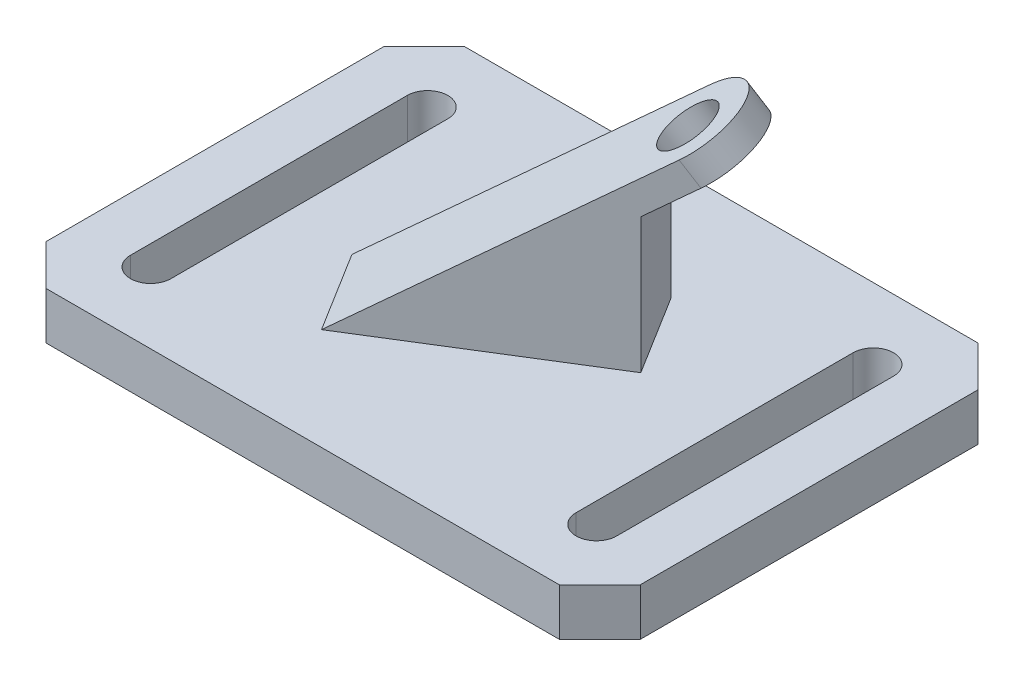
ISO-10303-21;
HEADER;
FILE_DESCRIPTION(('STEP AP214'),'2;1');
FILE_NAME('part.step','',(''),(''),'','','');
FILE_SCHEMA(('AUTOMOTIVE_DESIGN { 1 0 10303 214 1 1 1 1 }'));
ENDSEC;
DATA;
#1=APPLICATION_CONTEXT('core data for automotive mechanical design processes');
#2=APPLICATION_PROTOCOL_DEFINITION('international standard','automotive_design',2000,#1);
#3=PRODUCT_CONTEXT('',#1,'mechanical');
#4=PRODUCT('Part','Part','',(#3));
#5=PRODUCT_RELATED_PRODUCT_CATEGORY('part','',(#4));
#6=PRODUCT_DEFINITION_FORMATION('','',#4);
#7=PRODUCT_DEFINITION_CONTEXT('part definition',#1,'design');
#8=PRODUCT_DEFINITION('design','',#6,#7);
#9=PRODUCT_DEFINITION_SHAPE('','',#8);
#10=(LENGTH_UNIT() NAMED_UNIT(*) SI_UNIT(.MILLI.,.METRE.));
#11=(NAMED_UNIT(*) PLANE_ANGLE_UNIT() SI_UNIT($,.RADIAN.));
#12=(NAMED_UNIT(*) SI_UNIT($,.STERADIAN.) SOLID_ANGLE_UNIT());
#13=UNCERTAINTY_MEASURE_WITH_UNIT(LENGTH_MEASURE(1.E-05),#10,'distance_accuracy_value','');
#14=(GEOMETRIC_REPRESENTATION_CONTEXT(3) GLOBAL_UNCERTAINTY_ASSIGNED_CONTEXT((#13)) GLOBAL_UNIT_ASSIGNED_CONTEXT((#10,
#11,#12)) REPRESENTATION_CONTEXT('',''));
#15=CARTESIAN_POINT('',(0.,0.,0.));
#16=DIRECTION('',(0.,0.,1.));
#17=DIRECTION('',(1.,0.,0.));
#18=AXIS2_PLACEMENT_3D('',#15,#16,#17);
#19=CARTESIAN_POINT('',(17.7698072711224,39.0528467618868,-19.2795308317588));
#20=DIRECTION('',(0.499289040047183,-0.809016994374951,-0.310164403665674));
#21=DIRECTION('',(0.850985081019819,0.525189862698903,0.));
#22=AXIS2_PLACEMENT_3D('',#19,#20,#21);
#23=PLANE('',#22);
#24=CARTESIAN_POINT('',(16.0670555017936,34.4370930765119,-9.9810496299021));
#25=DIRECTION('',(-0.499289040047183,0.809016994374951,0.310164403665674));
#26=DIRECTION('',(-0.850985081019819,-0.525189862698903,0.));
#27=AXIS2_PLACEMENT_3D('',#24,#25,#26);
#28=CIRCLE('',#27,4.);
#29=CARTESIAN_POINT('',(12.6631151777143,32.3363336257162,-9.9810496299021));
#30=VERTEX_POINT('',#29);
#31=EDGE_CURVE('E427',#30,#30,#28,.T.);
#32=ORIENTED_EDGE('',*,*,#31,.F.);
#33=EDGE_LOOP('',(#32));
#34=FACE_BOUND('',#33,.T.);
#35=DIRECTION('',(0.687212407810359,0.587785252292468,-0.426904677579162));
#36=VECTOR('',#35,1.);
#37=CARTESIAN_POINT('',(25.157372090729,39.0528467618868,-7.38735331727008));
#38=LINE('',#37,#36);
#39=CARTESIAN_POINT('',(-12.3173925694985,7.,15.8924247292349));
#40=VERTEX_POINT('',#39);
#41=CARTESIAN_POINT('',(20.3468852360565,34.9383499958396,-4.39902057421596));
#42=VERTEX_POINT('',#41);
#43=EDGE_CURVE('E217',#40,#42,#38,.T.);
#44=ORIENTED_EDGE('',*,*,#43,.T.);
#45=CARTESIAN_POINT('',(16.6531028262532,34.9383499958395,-10.3451093314603));
#46=DIRECTION('',(-0.499289040047183,0.809016994374951,0.310164403665674));
#47=DIRECTION('',(-0.850985081019819,-0.525189862698903,0.));
#48=AXIS2_PLACEMENT_3D('',#45,#46,#47);
#49=CIRCLE('',#48,7.);
#50=CARTESIAN_POINT('',(12.9593204164499,34.9383499958396,-16.2911980887047));
#51=VERTEX_POINT('',#50);
#52=EDGE_CURVE('E204',#42,#51,#49,.T.);
#53=ORIENTED_EDGE('',*,*,#52,.T.);
#54=DIRECTION('',(0.687212407810359,0.587785252292468,-0.426904677579162));
#55=VECTOR('',#54,1.);
#56=CARTESIAN_POINT('',(17.7698072711224,39.0528467618868,-19.2795308317588));
#57=LINE('',#56,#55);
#58=CARTESIAN_POINT('',(-19.7049573891052,7.,4.00024721474618));
#59=VERTEX_POINT('',#58);
#60=EDGE_CURVE('E237',#59,#51,#57,.T.);
#61=ORIENTED_EDGE('',*,*,#60,.F.);
#62=DIRECTION('',(0.527683201400473,0.,0.849441251034907));
#63=VECTOR('',#62,1.);
#64=CARTESIAN_POINT('',(-19.7049573891052,7.,4.00024721474619));
#65=LINE('',#64,#63);
#66=EDGE_CURVE('E86',#59,#40,#65,.T.);
#67=ORIENTED_EDGE('',*,*,#66,.T.);
#68=EDGE_LOOP('',(#44,#53,#61,#67));
#69=FACE_BOUND('',#68,.T.);
#70=ADVANCED_FACE('F61',(#34,#69),#23,.F.);
#71=CARTESIAN_POINT('',(9.45877731415572,27.,-14.1166182827341));
#72=DIRECTION('',(-0.499289040047183,0.809016994374951,0.310164403665674));
#73=DIRECTION('',(-0.850985081019819,-0.525189862698903,0.));
#74=AXIS2_PLACEMENT_3D('',#71,#72,#73);
#75=PLANE('',#74);
#76=CARTESIAN_POINT('',(18.0642116619823,31.2010250990121,-11.2217072445648));
#77=DIRECTION('',(-0.499289040047183,0.809016994374951,0.310164403665674));
#78=DIRECTION('',(-0.850985081019819,-0.525189862698903,0.));
#79=AXIS2_PLACEMENT_3D('',#76,#77,#78);
#80=CIRCLE('',#79,4.);
#81=CARTESIAN_POINT('',(14.6602713379031,29.1002656482164,-11.2217072445648));
#82=VERTEX_POINT('',#81);
#83=EDGE_CURVE('E65',#82,#82,#80,.T.);
#84=ORIENTED_EDGE('',*,*,#83,.T.);
#85=EDGE_LOOP('',(#84));
#86=FACE_BOUND('',#85,.T.);
#87=CARTESIAN_POINT('',(18.6502589864419,31.7022820183397,-11.585766946123));
#88=DIRECTION('',(-0.499289040047183,0.809016994374951,0.310164403665674));
#89=DIRECTION('',(-0.850985081019819,-0.525189862698903,0.));
#90=AXIS2_PLACEMENT_3D('',#87,#88,#89);
#91=CIRCLE('',#90,7.);
#92=CARTESIAN_POINT('',(22.3440413962452,31.7022820183398,-5.63967818887865));
#93=VERTEX_POINT('',#92);
#94=CARTESIAN_POINT('',(14.9564765766386,31.7022820183397,-17.5318557033673));
#95=VERTEX_POINT('',#94);
#96=EDGE_CURVE('E78',#93,#95,#91,.T.);
#97=ORIENTED_EDGE('',*,*,#96,.F.);
#98=DIRECTION('',(-0.687212407810359,-0.587785252292468,0.426904677579162));
#99=VECTOR('',#98,1.);
#100=CARTESIAN_POINT('',(16.8463421337623,27.,-2.22444076824535));
#101=LINE('',#100,#99);
#102=CARTESIAN_POINT('',(16.8463421337623,27.,-2.22444076824535));
#103=VERTEX_POINT('',#102);
#104=EDGE_CURVE('E219',#93,#103,#101,.T.);
#105=ORIENTED_EDGE('',*,*,#104,.T.);
#106=DIRECTION('',(0.527683201400473,0.,0.849441251034907));
#107=VECTOR('',#106,1.);
#108=CARTESIAN_POINT('',(9.45877731415572,27.,-14.1166182827341));
#109=LINE('',#108,#107);
#110=CARTESIAN_POINT('',(9.45877731415572,27.,-14.1166182827341));
#111=VERTEX_POINT('',#110);
#112=EDGE_CURVE('E243',#111,#103,#109,.T.);
#113=ORIENTED_EDGE('',*,*,#112,.F.);
#114=DIRECTION('',(-0.687212407810359,-0.587785252292468,0.426904677579162));
#115=VECTOR('',#114,1.);
#116=CARTESIAN_POINT('',(9.45877731415572,27.,-14.1166182827341));
#117=LINE('',#116,#115);
#118=EDGE_CURVE('E421',#95,#111,#117,.T.);
#119=ORIENTED_EDGE('',*,*,#118,.F.);
#120=EDGE_LOOP('',(#97,#105,#113,#119));
#121=FACE_BOUND('',#120,.T.);
#122=ADVANCED_FACE('F436',(#86,#121),#75,.F.);
#123=CARTESIAN_POINT('',(0.,7.,0.));
#124=DIRECTION('',(0.,-1.,0.));
#125=DIRECTION('',(0.,0.,-1.));
#126=AXIS2_PLACEMENT_3D('',#123,#124,#125);
#127=PLANE('',#126);
#128=ORIENTED_EDGE('',*,*,#66,.F.);
#129=DIRECTION('',(-0.849441251034907,0.,0.527683201400473));
#130=VECTOR('',#129,1.);
#131=CARTESIAN_POINT('',(9.45877731415572,7.,-14.1166182827341));
#132=LINE('',#131,#130);
#133=CARTESIAN_POINT('',(9.45877731415572,7.,-14.1166182827341));
#134=VERTEX_POINT('',#133);
#135=EDGE_CURVE('E228',#134,#59,#132,.T.);
#136=ORIENTED_EDGE('',*,*,#135,.F.);
#137=DIRECTION('',(0.527683201400473,0.,0.849441251034907));
#138=VECTOR('',#137,1.);
#139=CARTESIAN_POINT('',(9.45877731415572,7.,-14.1166182827341));
#140=LINE('',#139,#138);
#141=CARTESIAN_POINT('',(16.8463421337623,7.,-2.22444076824535));
#142=VERTEX_POINT('',#141);
#143=EDGE_CURVE('E240',#134,#142,#140,.T.);
#144=ORIENTED_EDGE('',*,*,#143,.T.);
#145=DIRECTION('',(-0.849441251034907,0.,0.527683201400473));
#146=VECTOR('',#145,1.);
#147=CARTESIAN_POINT('',(-12.3173925694985,7.,15.8924247292349));
#148=LINE('',#147,#146);
#149=EDGE_CURVE('E234',#142,#40,#148,.T.);
#150=ORIENTED_EDGE('',*,*,#149,.T.);
#151=EDGE_LOOP('',(#128,#136,#144,#150));
#152=FACE_BOUND('',#151,.T.);
#153=CARTESIAN_POINT('',(-33.,7.,20.5));
#154=DIRECTION('',(0.,1.,0.));
#155=DIRECTION('',(0.,0.,1.));
#156=AXIS2_PLACEMENT_3D('',#153,#154,#155);
#157=CIRCLE('',#156,3.);
#158=CARTESIAN_POINT('',(-36.,7.,20.5));
#159=VERTEX_POINT('',#158);
#160=CARTESIAN_POINT('',(-30.,7.,20.5));
#161=VERTEX_POINT('',#160);
#162=EDGE_CURVE('E291',#159,#161,#157,.T.);
#163=ORIENTED_EDGE('',*,*,#162,.F.);
#164=DIRECTION('',(0.,0.,1.));
#165=VECTOR('',#164,1.);
#166=CARTESIAN_POINT('',(-36.,7.,20.5));
#167=LINE('',#166,#165);
#168=CARTESIAN_POINT('',(-36.,7.,-20.5));
#169=VERTEX_POINT('',#168);
#170=EDGE_CURVE('E302',#169,#159,#167,.T.);
#171=ORIENTED_EDGE('',*,*,#170,.F.);
#172=CARTESIAN_POINT('',(-33.,7.,-20.5));
#173=DIRECTION('',(0.,1.,0.));
#174=DIRECTION('',(0.,0.,1.));
#175=AXIS2_PLACEMENT_3D('',#172,#173,#174);
#176=CIRCLE('',#175,3.00000000000002);
#177=CARTESIAN_POINT('',(-30.,7.,-20.5));
#178=VERTEX_POINT('',#177);
#179=EDGE_CURVE('E298',#178,#169,#176,.T.);
#180=ORIENTED_EDGE('',*,*,#179,.F.);
#181=DIRECTION('',(0.,0.,-1.));
#182=VECTOR('',#181,1.);
#183=CARTESIAN_POINT('',(-30.,7.,20.5));
#184=LINE('',#183,#182);
#185=EDGE_CURVE('E294',#161,#178,#184,.T.);
#186=ORIENTED_EDGE('',*,*,#185,.F.);
#187=EDGE_LOOP('',(#163,#171,#180,#186));
#188=FACE_BOUND('',#187,.T.);
#189=DIRECTION('',(-1.,0.,0.));
#190=VECTOR('',#189,1.);
#191=CARTESIAN_POINT('',(-38.,7.,-31.));
#192=LINE('',#191,#190);
#193=CARTESIAN_POINT('',(38.,7.,-31.));
#194=VERTEX_POINT('',#193);
#195=CARTESIAN_POINT('',(-38.,7.,-31.));
#196=VERTEX_POINT('',#195);
#197=EDGE_CURVE('E334',#194,#196,#192,.T.);
#198=ORIENTED_EDGE('',*,*,#197,.T.);
#199=DIRECTION('',(-0.707106781186547,0.,0.707106781186548));
#200=VECTOR('',#199,1.);
#201=CARTESIAN_POINT('',(-44.,7.,-25.));
#202=LINE('',#201,#200);
#203=CARTESIAN_POINT('',(-44.,7.,-25.));
#204=VERTEX_POINT('',#203);
#205=EDGE_CURVE('E338',#196,#204,#202,.T.);
#206=ORIENTED_EDGE('',*,*,#205,.T.);
#207=DIRECTION('',(0.,0.,1.));
#208=VECTOR('',#207,1.);
#209=CARTESIAN_POINT('',(-44.,7.,-25.));
#210=LINE('',#209,#208);
#211=CARTESIAN_POINT('',(-44.,7.,25.));
#212=VERTEX_POINT('',#211);
#213=EDGE_CURVE('E342',#204,#212,#210,.T.);
#214=ORIENTED_EDGE('',*,*,#213,.T.);
#215=DIRECTION('',(0.707106781186547,0.,0.707106781186548));
#216=VECTOR('',#215,1.);
#217=CARTESIAN_POINT('',(-44.,7.,25.));
#218=LINE('',#217,#216);
#219=CARTESIAN_POINT('',(-38.,7.,31.));
#220=VERTEX_POINT('',#219);
#221=EDGE_CURVE('E345',#212,#220,#218,.T.);
#222=ORIENTED_EDGE('',*,*,#221,.T.);
#223=DIRECTION('',(1.,0.,0.));
#224=VECTOR('',#223,1.);
#225=CARTESIAN_POINT('',(-38.,7.,31.));
#226=LINE('',#225,#224);
#227=CARTESIAN_POINT('',(38.,7.,31.));
#228=VERTEX_POINT('',#227);
#229=EDGE_CURVE('E348',#220,#228,#226,.T.);
#230=ORIENTED_EDGE('',*,*,#229,.T.);
#231=DIRECTION('',(0.707106781186548,0.,-0.707106781186547));
#232=VECTOR('',#231,1.);
#233=CARTESIAN_POINT('',(38.,7.,31.));
#234=LINE('',#233,#232);
#235=CARTESIAN_POINT('',(44.,7.,25.));
#236=VERTEX_POINT('',#235);
#237=EDGE_CURVE('E351',#228,#236,#234,.T.);
#238=ORIENTED_EDGE('',*,*,#237,.T.);
#239=DIRECTION('',(0.,0.,-1.));
#240=VECTOR('',#239,1.);
#241=CARTESIAN_POINT('',(44.,7.,-25.));
#242=LINE('',#241,#240);
#243=CARTESIAN_POINT('',(44.,7.,-25.));
#244=VERTEX_POINT('',#243);
#245=EDGE_CURVE('E354',#236,#244,#242,.T.);
#246=ORIENTED_EDGE('',*,*,#245,.T.);
#247=DIRECTION('',(-0.707106781186548,0.,-0.707106781186547));
#248=VECTOR('',#247,1.);
#249=CARTESIAN_POINT('',(38.,7.,-31.));
#250=LINE('',#249,#248);
#251=EDGE_CURVE('E357',#244,#194,#250,.T.);
#252=ORIENTED_EDGE('',*,*,#251,.T.);
#253=EDGE_LOOP('',(#198,#206,#214,#222,#230,#238,#246,#252));
#254=FACE_BOUND('',#253,.T.);
#255=CARTESIAN_POINT('',(33.,7.,20.5));
#256=DIRECTION('',(0.,1.,0.));
#257=DIRECTION('',(0.,0.,1.));
#258=AXIS2_PLACEMENT_3D('',#255,#256,#257);
#259=CIRCLE('',#258,3.);
#260=CARTESIAN_POINT('',(30.,7.,20.5));
#261=VERTEX_POINT('',#260);
#262=CARTESIAN_POINT('',(36.,7.,20.5));
#263=VERTEX_POINT('',#262);
#264=EDGE_CURVE('E248',#261,#263,#259,.T.);
#265=ORIENTED_EDGE('',*,*,#264,.F.);
#266=DIRECTION('',(0.,0.,1.));
#267=VECTOR('',#266,1.);
#268=CARTESIAN_POINT('',(30.,7.,20.5));
#269=LINE('',#268,#267);
#270=CARTESIAN_POINT('',(30.,7.,-20.5));
#271=VERTEX_POINT('',#270);
#272=EDGE_CURVE('E259',#271,#261,#269,.T.);
#273=ORIENTED_EDGE('',*,*,#272,.F.);
#274=CARTESIAN_POINT('',(33.,7.,-20.5));
#275=DIRECTION('',(0.,1.,0.));
#276=DIRECTION('',(0.,0.,1.));
#277=AXIS2_PLACEMENT_3D('',#274,#275,#276);
#278=CIRCLE('',#277,3.);
#279=CARTESIAN_POINT('',(36.,7.,-20.5));
#280=VERTEX_POINT('',#279);
#281=EDGE_CURVE('E255',#280,#271,#278,.T.);
#282=ORIENTED_EDGE('',*,*,#281,.F.);
#283=DIRECTION('',(0.,0.,-1.));
#284=VECTOR('',#283,1.);
#285=CARTESIAN_POINT('',(36.,7.,20.5));
#286=LINE('',#285,#284);
#287=EDGE_CURVE('E251',#263,#280,#286,.T.);
#288=ORIENTED_EDGE('',*,*,#287,.F.);
#289=EDGE_LOOP('',(#265,#273,#282,#288));
#290=FACE_BOUND('',#289,.T.);
#291=ADVANCED_FACE('F453',(#152,#188,#254,#290),#127,.F.);
#292=CARTESIAN_POINT('',(0.,0.,0.));
#293=DIRECTION('',(0.,-1.,0.));
#294=DIRECTION('',(0.,0.,-1.));
#295=AXIS2_PLACEMENT_3D('',#292,#293,#294);
#296=PLANE('',#295);
#297=DIRECTION('',(-1.,0.,0.));
#298=VECTOR('',#297,1.);
#299=CARTESIAN_POINT('',(-38.,0.,-31.));
#300=LINE('',#299,#298);
#301=CARTESIAN_POINT('',(38.,0.,-31.));
#302=VERTEX_POINT('',#301);
#303=CARTESIAN_POINT('',(-38.,0.,-31.));
#304=VERTEX_POINT('',#303);
#305=EDGE_CURVE('E333',#302,#304,#300,.T.);
#306=ORIENTED_EDGE('',*,*,#305,.F.);
#307=DIRECTION('',(-0.707106781186548,0.,-0.707106781186547));
#308=VECTOR('',#307,1.);
#309=CARTESIAN_POINT('',(38.,0.,-31.));
#310=LINE('',#309,#308);
#311=CARTESIAN_POINT('',(44.,0.,-25.));
#312=VERTEX_POINT('',#311);
#313=EDGE_CURVE('E339',#312,#302,#310,.T.);
#314=ORIENTED_EDGE('',*,*,#313,.F.);
#315=DIRECTION('',(0.,0.,-1.));
#316=VECTOR('',#315,1.);
#317=CARTESIAN_POINT('',(44.,0.,-25.));
#318=LINE('',#317,#316);
#319=CARTESIAN_POINT('',(44.,0.,25.));
#320=VERTEX_POINT('',#319);
#321=EDGE_CURVE('E379',#320,#312,#318,.T.);
#322=ORIENTED_EDGE('',*,*,#321,.F.);
#323=DIRECTION('',(0.707106781186548,0.,-0.707106781186547));
#324=VECTOR('',#323,1.);
#325=CARTESIAN_POINT('',(38.,0.,31.));
#326=LINE('',#325,#324);
#327=CARTESIAN_POINT('',(38.,0.,31.));
#328=VERTEX_POINT('',#327);
#329=EDGE_CURVE('E376',#328,#320,#326,.T.);
#330=ORIENTED_EDGE('',*,*,#329,.F.);
#331=DIRECTION('',(1.,0.,0.));
#332=VECTOR('',#331,1.);
#333=CARTESIAN_POINT('',(-38.,0.,31.));
#334=LINE('',#333,#332);
#335=CARTESIAN_POINT('',(-38.,0.,31.));
#336=VERTEX_POINT('',#335);
#337=EDGE_CURVE('E373',#336,#328,#334,.T.);
#338=ORIENTED_EDGE('',*,*,#337,.F.);
#339=DIRECTION('',(0.707106781186547,0.,0.707106781186548));
#340=VECTOR('',#339,1.);
#341=CARTESIAN_POINT('',(-44.,0.,25.));
#342=LINE('',#341,#340);
#343=CARTESIAN_POINT('',(-44.,0.,25.));
#344=VERTEX_POINT('',#343);
#345=EDGE_CURVE('E370',#344,#336,#342,.T.);
#346=ORIENTED_EDGE('',*,*,#345,.F.);
#347=DIRECTION('',(0.,0.,1.));
#348=VECTOR('',#347,1.);
#349=CARTESIAN_POINT('',(-44.,0.,-25.));
#350=LINE('',#349,#348);
#351=CARTESIAN_POINT('',(-44.,0.,-25.));
#352=VERTEX_POINT('',#351);
#353=EDGE_CURVE('E367',#352,#344,#350,.T.);
#354=ORIENTED_EDGE('',*,*,#353,.F.);
#355=DIRECTION('',(-0.707106781186547,0.,0.707106781186548));
#356=VECTOR('',#355,1.);
#357=CARTESIAN_POINT('',(-44.,0.,-25.));
#358=LINE('',#357,#356);
#359=EDGE_CURVE('E364',#304,#352,#358,.T.);
#360=ORIENTED_EDGE('',*,*,#359,.F.);
#361=EDGE_LOOP('',(#306,#314,#322,#330,#338,#346,#354,#360));
#362=FACE_BOUND('',#361,.T.);
#363=DIRECTION('',(0.,0.,1.));
#364=VECTOR('',#363,1.);
#365=CARTESIAN_POINT('',(-36.,0.,20.5));
#366=LINE('',#365,#364);
#367=CARTESIAN_POINT('',(-36.,0.,-20.5));
#368=VERTEX_POINT('',#367);
#369=CARTESIAN_POINT('',(-36.,0.,20.5));
#370=VERTEX_POINT('',#369);
#371=EDGE_CURVE('E295',#368,#370,#366,.T.);
#372=ORIENTED_EDGE('',*,*,#371,.T.);
#373=CARTESIAN_POINT('',(-33.,0.,20.5));
#374=DIRECTION('',(0.,1.,0.));
#375=DIRECTION('',(0.,0.,1.));
#376=AXIS2_PLACEMENT_3D('',#373,#374,#375);
#377=CIRCLE('',#376,3.);
#378=CARTESIAN_POINT('',(-30.,0.,20.5));
#379=VERTEX_POINT('',#378);
#380=EDGE_CURVE('E290',#370,#379,#377,.T.);
#381=ORIENTED_EDGE('',*,*,#380,.T.);
#382=DIRECTION('',(0.,0.,-1.));
#383=VECTOR('',#382,1.);
#384=CARTESIAN_POINT('',(-30.,0.,20.5));
#385=LINE('',#384,#383);
#386=CARTESIAN_POINT('',(-30.,0.,-20.5));
#387=VERTEX_POINT('',#386);
#388=EDGE_CURVE('E309',#379,#387,#385,.T.);
#389=ORIENTED_EDGE('',*,*,#388,.T.);
#390=CARTESIAN_POINT('',(-33.,0.,-20.5));
#391=DIRECTION('',(0.,1.,0.));
#392=DIRECTION('',(0.,0.,1.));
#393=AXIS2_PLACEMENT_3D('',#390,#391,#392);
#394=CIRCLE('',#393,3.00000000000002);
#395=EDGE_CURVE('E313',#387,#368,#394,.T.);
#396=ORIENTED_EDGE('',*,*,#395,.T.);
#397=EDGE_LOOP('',(#372,#381,#389,#396));
#398=FACE_BOUND('',#397,.T.);
#399=DIRECTION('',(0.,0.,1.));
#400=VECTOR('',#399,1.);
#401=CARTESIAN_POINT('',(30.,0.,20.5));
#402=LINE('',#401,#400);
#403=CARTESIAN_POINT('',(30.,0.,-20.5));
#404=VERTEX_POINT('',#403);
#405=CARTESIAN_POINT('',(30.,0.,20.5));
#406=VERTEX_POINT('',#405);
#407=EDGE_CURVE('E252',#404,#406,#402,.T.);
#408=ORIENTED_EDGE('',*,*,#407,.T.);
#409=CARTESIAN_POINT('',(33.,0.,20.5));
#410=DIRECTION('',(0.,1.,0.));
#411=DIRECTION('',(0.,0.,1.));
#412=AXIS2_PLACEMENT_3D('',#409,#410,#411);
#413=CIRCLE('',#412,3.);
#414=CARTESIAN_POINT('',(36.,0.,20.5));
#415=VERTEX_POINT('',#414);
#416=EDGE_CURVE('E247',#406,#415,#413,.T.);
#417=ORIENTED_EDGE('',*,*,#416,.T.);
#418=DIRECTION('',(0.,0.,-1.));
#419=VECTOR('',#418,1.);
#420=CARTESIAN_POINT('',(36.,0.,20.5));
#421=LINE('',#420,#419);
#422=CARTESIAN_POINT('',(36.,0.,-20.5));
#423=VERTEX_POINT('',#422);
#424=EDGE_CURVE('E266',#415,#423,#421,.T.);
#425=ORIENTED_EDGE('',*,*,#424,.T.);
#426=CARTESIAN_POINT('',(33.,0.,-20.5));
#427=DIRECTION('',(0.,1.,0.));
#428=DIRECTION('',(0.,0.,1.));
#429=AXIS2_PLACEMENT_3D('',#426,#427,#428);
#430=CIRCLE('',#429,3.);
#431=EDGE_CURVE('E270',#423,#404,#430,.T.);
#432=ORIENTED_EDGE('',*,*,#431,.T.);
#433=EDGE_LOOP('',(#408,#417,#425,#432));
#434=FACE_BOUND('',#433,.T.);
#435=ADVANCED_FACE('F492',(#362,#398,#434),#296,.T.);
#436=CARTESIAN_POINT('',(-38.,7.,-31.));
#437=DIRECTION('',(0.,0.,1.));
#438=DIRECTION('',(1.,0.,0.));
#439=AXIS2_PLACEMENT_3D('',#436,#437,#438);
#440=PLANE('',#439);
#441=ORIENTED_EDGE('',*,*,#305,.T.);
#442=DIRECTION('',(0.,-1.,0.));
#443=VECTOR('',#442,1.);
#444=CARTESIAN_POINT('',(-38.,7.,-31.));
#445=LINE('',#444,#443);
#446=EDGE_CURVE('E411',#196,#304,#445,.T.);
#447=ORIENTED_EDGE('',*,*,#446,.F.);
#448=ORIENTED_EDGE('',*,*,#197,.F.);
#449=DIRECTION('',(0.,-1.,0.));
#450=VECTOR('',#449,1.);
#451=CARTESIAN_POINT('',(38.,7.,-31.));
#452=LINE('',#451,#450);
#453=EDGE_CURVE('E360',#194,#302,#452,.T.);
#454=ORIENTED_EDGE('',*,*,#453,.T.);
#455=EDGE_LOOP('',(#441,#447,#448,#454));
#456=FACE_BOUND('',#455,.T.);
#457=ADVANCED_FACE('F63',(#456),#440,.F.);
#458=CARTESIAN_POINT('',(-44.,7.,-25.));
#459=DIRECTION('',(0.707106781186548,0.,0.707106781186547));
#460=DIRECTION('',(0.707106781186547,0.,-0.707106781186548));
#461=AXIS2_PLACEMENT_3D('',#458,#459,#460);
#462=PLANE('',#461);
#463=ORIENTED_EDGE('',*,*,#359,.T.);
#464=DIRECTION('',(0.,-1.,0.));
#465=VECTOR('',#464,1.);
#466=CARTESIAN_POINT('',(-44.,7.,-25.));
#467=LINE('',#466,#465);
#468=EDGE_CURVE('E407',#204,#352,#467,.T.);
#469=ORIENTED_EDGE('',*,*,#468,.F.);
#470=ORIENTED_EDGE('',*,*,#205,.F.);
#471=ORIENTED_EDGE('',*,*,#446,.T.);
#472=EDGE_LOOP('',(#463,#469,#470,#471));
#473=FACE_BOUND('',#472,.T.);
#474=ADVANCED_FACE('F517',(#473),#462,.F.);
#475=CARTESIAN_POINT('',(-44.,7.,-25.));
#476=DIRECTION('',(1.,0.,0.));
#477=DIRECTION('',(0.,0.,-1.));
#478=AXIS2_PLACEMENT_3D('',#475,#476,#477);
#479=PLANE('',#478);
#480=ORIENTED_EDGE('',*,*,#353,.T.);
#481=DIRECTION('',(0.,-1.,0.));
#482=VECTOR('',#481,1.);
#483=CARTESIAN_POINT('',(-44.,7.,25.));
#484=LINE('',#483,#482);
#485=EDGE_CURVE('E403',#212,#344,#484,.T.);
#486=ORIENTED_EDGE('',*,*,#485,.F.);
#487=ORIENTED_EDGE('',*,*,#213,.F.);
#488=ORIENTED_EDGE('',*,*,#468,.T.);
#489=EDGE_LOOP('',(#480,#486,#487,#488));
#490=FACE_BOUND('',#489,.T.);
#491=ADVANCED_FACE('F514',(#490),#479,.F.);
#492=CARTESIAN_POINT('',(-44.,7.,25.));
#493=DIRECTION('',(0.707106781186548,0.,-0.707106781186547));
#494=DIRECTION('',(-0.707106781186547,0.,-0.707106781186548));
#495=AXIS2_PLACEMENT_3D('',#492,#493,#494);
#496=PLANE('',#495);
#497=ORIENTED_EDGE('',*,*,#345,.T.);
#498=DIRECTION('',(0.,-1.,0.));
#499=VECTOR('',#498,1.);
#500=CARTESIAN_POINT('',(-38.,7.,31.));
#501=LINE('',#500,#499);
#502=EDGE_CURVE('E399',#220,#336,#501,.T.);
#503=ORIENTED_EDGE('',*,*,#502,.F.);
#504=ORIENTED_EDGE('',*,*,#221,.F.);
#505=ORIENTED_EDGE('',*,*,#485,.T.);
#506=EDGE_LOOP('',(#497,#503,#504,#505));
#507=FACE_BOUND('',#506,.T.);
#508=ADVANCED_FACE('F510',(#507),#496,.F.);
#509=CARTESIAN_POINT('',(-38.,7.,31.));
#510=DIRECTION('',(0.,0.,-1.));
#511=DIRECTION('',(-1.,0.,0.));
#512=AXIS2_PLACEMENT_3D('',#509,#510,#511);
#513=PLANE('',#512);
#514=ORIENTED_EDGE('',*,*,#337,.T.);
#515=DIRECTION('',(0.,-1.,0.));
#516=VECTOR('',#515,1.);
#517=CARTESIAN_POINT('',(38.,7.,31.));
#518=LINE('',#517,#516);
#519=EDGE_CURVE('E395',#228,#328,#518,.T.);
#520=ORIENTED_EDGE('',*,*,#519,.F.);
#521=ORIENTED_EDGE('',*,*,#229,.F.);
#522=ORIENTED_EDGE('',*,*,#502,.T.);
#523=EDGE_LOOP('',(#514,#520,#521,#522));
#524=FACE_BOUND('',#523,.T.);
#525=ADVANCED_FACE('F506',(#524),#513,.F.);
#526=CARTESIAN_POINT('',(38.,7.,31.));
#527=DIRECTION('',(-0.707106781186547,0.,-0.707106781186548));
#528=DIRECTION('',(-0.707106781186548,0.,0.707106781186547));
#529=AXIS2_PLACEMENT_3D('',#526,#527,#528);
#530=PLANE('',#529);
#531=ORIENTED_EDGE('',*,*,#329,.T.);
#532=DIRECTION('',(0.,-1.,0.));
#533=VECTOR('',#532,1.);
#534=CARTESIAN_POINT('',(44.,7.,25.));
#535=LINE('',#534,#533);
#536=EDGE_CURVE('E391',#236,#320,#535,.T.);
#537=ORIENTED_EDGE('',*,*,#536,.F.);
#538=ORIENTED_EDGE('',*,*,#237,.F.);
#539=ORIENTED_EDGE('',*,*,#519,.T.);
#540=EDGE_LOOP('',(#531,#537,#538,#539));
#541=FACE_BOUND('',#540,.T.);
#542=ADVANCED_FACE('F502',(#541),#530,.F.);
#543=CARTESIAN_POINT('',(44.,7.,-25.));
#544=DIRECTION('',(-1.,0.,0.));
#545=DIRECTION('',(0.,0.,1.));
#546=AXIS2_PLACEMENT_3D('',#543,#544,#545);
#547=PLANE('',#546);
#548=ORIENTED_EDGE('',*,*,#321,.T.);
#549=DIRECTION('',(0.,-1.,0.));
#550=VECTOR('',#549,1.);
#551=CARTESIAN_POINT('',(44.,7.,-25.));
#552=LINE('',#551,#550);
#553=EDGE_CURVE('E387',#244,#312,#552,.T.);
#554=ORIENTED_EDGE('',*,*,#553,.F.);
#555=ORIENTED_EDGE('',*,*,#245,.F.);
#556=ORIENTED_EDGE('',*,*,#536,.T.);
#557=EDGE_LOOP('',(#548,#554,#555,#556));
#558=FACE_BOUND('',#557,.T.);
#559=ADVANCED_FACE('F498',(#558),#547,.F.);
#560=CARTESIAN_POINT('',(38.,7.,-31.));
#561=DIRECTION('',(-0.707106781186547,0.,0.707106781186548));
#562=DIRECTION('',(0.707106781186548,0.,0.707106781186547));
#563=AXIS2_PLACEMENT_3D('',#560,#561,#562);
#564=PLANE('',#563);
#565=ORIENTED_EDGE('',*,*,#313,.T.);
#566=ORIENTED_EDGE('',*,*,#453,.F.);
#567=ORIENTED_EDGE('',*,*,#251,.F.);
#568=ORIENTED_EDGE('',*,*,#553,.T.);
#569=EDGE_LOOP('',(#565,#566,#567,#568));
#570=FACE_BOUND('',#569,.T.);
#571=ADVANCED_FACE('F488',(#570),#564,.F.);
#572=CARTESIAN_POINT('',(-33.,7.,20.5));
#573=DIRECTION('',(0.,-1.,0.));
#574=DIRECTION('',(0.,0.,-1.));
#575=AXIS2_PLACEMENT_3D('',#572,#573,#574);
#576=CYLINDRICAL_SURFACE('',#575,3.);
#577=ORIENTED_EDGE('',*,*,#380,.F.);
#578=DIRECTION('',(0.,-1.,0.));
#579=VECTOR('',#578,1.);
#580=CARTESIAN_POINT('',(-36.,7.,20.5));
#581=LINE('',#580,#579);
#582=EDGE_CURVE('E305',#159,#370,#581,.T.);
#583=ORIENTED_EDGE('',*,*,#582,.F.);
#584=ORIENTED_EDGE('',*,*,#162,.T.);
#585=DIRECTION('',(0.,-1.,0.));
#586=VECTOR('',#585,1.);
#587=CARTESIAN_POINT('',(-30.,7.,20.5));
#588=LINE('',#587,#586);
#589=EDGE_CURVE('E329',#161,#379,#588,.T.);
#590=ORIENTED_EDGE('',*,*,#589,.T.);
#591=EDGE_LOOP('',(#577,#583,#584,#590));
#592=FACE_BOUND('',#591,.T.);
#593=ADVANCED_FACE('F484',(#592),#576,.F.);
#594=CARTESIAN_POINT('',(-30.,7.,20.5));
#595=DIRECTION('',(-1.,0.,0.));
#596=DIRECTION('',(0.,0.,1.));
#597=AXIS2_PLACEMENT_3D('',#594,#595,#596);
#598=PLANE('',#597);
#599=ORIENTED_EDGE('',*,*,#388,.F.);
#600=ORIENTED_EDGE('',*,*,#589,.F.);
#601=ORIENTED_EDGE('',*,*,#185,.T.);
#602=DIRECTION('',(0.,-1.,0.));
#603=VECTOR('',#602,1.);
#604=CARTESIAN_POINT('',(-30.,7.,-20.5));
#605=LINE('',#604,#603);
#606=EDGE_CURVE('E326',#178,#387,#605,.T.);
#607=ORIENTED_EDGE('',*,*,#606,.T.);
#608=EDGE_LOOP('',(#599,#600,#601,#607));
#609=FACE_BOUND('',#608,.T.);
#610=ADVANCED_FACE('F480',(#609),#598,.T.);
#611=CARTESIAN_POINT('',(-33.,7.,-20.5));
#612=DIRECTION('',(0.,-1.,0.));
#613=DIRECTION('',(0.,0.,-1.));
#614=AXIS2_PLACEMENT_3D('',#611,#612,#613);
#615=CYLINDRICAL_SURFACE('',#614,3.00000000000002);
#616=ORIENTED_EDGE('',*,*,#395,.F.);
#617=ORIENTED_EDGE('',*,*,#606,.F.);
#618=ORIENTED_EDGE('',*,*,#179,.T.);
#619=DIRECTION('',(0.,-1.,0.));
#620=VECTOR('',#619,1.);
#621=CARTESIAN_POINT('',(-36.,7.,-20.5));
#622=LINE('',#621,#620);
#623=EDGE_CURVE('E323',#169,#368,#622,.T.);
#624=ORIENTED_EDGE('',*,*,#623,.T.);
#625=EDGE_LOOP('',(#616,#617,#618,#624));
#626=FACE_BOUND('',#625,.T.);
#627=ADVANCED_FACE('F476',(#626),#615,.F.);
#628=CARTESIAN_POINT('',(-36.,7.,20.5));
#629=DIRECTION('',(1.,0.,0.));
#630=DIRECTION('',(0.,0.,-1.));
#631=AXIS2_PLACEMENT_3D('',#628,#629,#630);
#632=PLANE('',#631);
#633=ORIENTED_EDGE('',*,*,#371,.F.);
#634=ORIENTED_EDGE('',*,*,#623,.F.);
#635=ORIENTED_EDGE('',*,*,#170,.T.);
#636=ORIENTED_EDGE('',*,*,#582,.T.);
#637=EDGE_LOOP('',(#633,#634,#635,#636));
#638=FACE_BOUND('',#637,.T.);
#639=ADVANCED_FACE('F472',(#638),#632,.T.);
#640=CARTESIAN_POINT('',(33.,7.,20.5));
#641=DIRECTION('',(0.,-1.,0.));
#642=DIRECTION('',(0.,0.,-1.));
#643=AXIS2_PLACEMENT_3D('',#640,#641,#642);
#644=CYLINDRICAL_SURFACE('',#643,3.);
#645=ORIENTED_EDGE('',*,*,#416,.F.);
#646=DIRECTION('',(0.,-1.,0.));
#647=VECTOR('',#646,1.);
#648=CARTESIAN_POINT('',(30.,7.,20.5));
#649=LINE('',#648,#647);
#650=EDGE_CURVE('E262',#261,#406,#649,.T.);
#651=ORIENTED_EDGE('',*,*,#650,.F.);
#652=ORIENTED_EDGE('',*,*,#264,.T.);
#653=DIRECTION('',(0.,-1.,0.));
#654=VECTOR('',#653,1.);
#655=CARTESIAN_POINT('',(36.,7.,20.5));
#656=LINE('',#655,#654);
#657=EDGE_CURVE('E286',#263,#415,#656,.T.);
#658=ORIENTED_EDGE('',*,*,#657,.T.);
#659=EDGE_LOOP('',(#645,#651,#652,#658));
#660=FACE_BOUND('',#659,.T.);
#661=ADVANCED_FACE('F468',(#660),#644,.F.);
#662=CARTESIAN_POINT('',(36.,7.,20.5));
#663=DIRECTION('',(-1.,0.,0.));
#664=DIRECTION('',(0.,0.,1.));
#665=AXIS2_PLACEMENT_3D('',#662,#663,#664);
#666=PLANE('',#665);
#667=ORIENTED_EDGE('',*,*,#424,.F.);
#668=ORIENTED_EDGE('',*,*,#657,.F.);
#669=ORIENTED_EDGE('',*,*,#287,.T.);
#670=DIRECTION('',(0.,-1.,0.));
#671=VECTOR('',#670,1.);
#672=CARTESIAN_POINT('',(36.,7.,-20.5));
#673=LINE('',#672,#671);
#674=EDGE_CURVE('E283',#280,#423,#673,.T.);
#675=ORIENTED_EDGE('',*,*,#674,.T.);
#676=EDGE_LOOP('',(#667,#668,#669,#675));
#677=FACE_BOUND('',#676,.T.);
#678=ADVANCED_FACE('F464',(#677),#666,.T.);
#679=CARTESIAN_POINT('',(33.,7.,-20.5));
#680=DIRECTION('',(0.,-1.,0.));
#681=DIRECTION('',(0.,0.,-1.));
#682=AXIS2_PLACEMENT_3D('',#679,#680,#681);
#683=CYLINDRICAL_SURFACE('',#682,3.);
#684=ORIENTED_EDGE('',*,*,#431,.F.);
#685=ORIENTED_EDGE('',*,*,#674,.F.);
#686=ORIENTED_EDGE('',*,*,#281,.T.);
#687=DIRECTION('',(0.,-1.,0.));
#688=VECTOR('',#687,1.);
#689=CARTESIAN_POINT('',(30.,7.,-20.5));
#690=LINE('',#689,#688);
#691=EDGE_CURVE('E280',#271,#404,#690,.T.);
#692=ORIENTED_EDGE('',*,*,#691,.T.);
#693=EDGE_LOOP('',(#684,#685,#686,#692));
#694=FACE_BOUND('',#693,.T.);
#695=ADVANCED_FACE('F460',(#694),#683,.F.);
#696=CARTESIAN_POINT('',(30.,7.,20.5));
#697=DIRECTION('',(1.,0.,0.));
#698=DIRECTION('',(0.,0.,-1.));
#699=AXIS2_PLACEMENT_3D('',#696,#697,#698);
#700=PLANE('',#699);
#701=ORIENTED_EDGE('',*,*,#407,.F.);
#702=ORIENTED_EDGE('',*,*,#691,.F.);
#703=ORIENTED_EDGE('',*,*,#272,.T.);
#704=ORIENTED_EDGE('',*,*,#650,.T.);
#705=EDGE_LOOP('',(#701,#702,#703,#704));
#706=FACE_BOUND('',#705,.T.);
#707=ADVANCED_FACE('F457',(#706),#700,.T.);
#708=CARTESIAN_POINT('',(9.45877731415572,27.,-14.1166182827341));
#709=DIRECTION('',(-0.849441251034907,0.,0.527683201400473));
#710=DIRECTION('',(0.527683201400473,0.,0.849441251034907));
#711=AXIS2_PLACEMENT_3D('',#708,#709,#710);
#712=PLANE('',#711);
#713=DIRECTION('',(0.,-1.,0.));
#714=VECTOR('',#713,1.);
#715=CARTESIAN_POINT('',(16.8463421337623,27.,-2.22444076824535));
#716=LINE('',#715,#714);
#717=EDGE_CURVE('E224',#103,#142,#716,.T.);
#718=ORIENTED_EDGE('',*,*,#717,.T.);
#719=ORIENTED_EDGE('',*,*,#143,.F.);
#720=DIRECTION('',(0.,-1.,0.));
#721=VECTOR('',#720,1.);
#722=CARTESIAN_POINT('',(9.45877731415572,27.,-14.1166182827341));
#723=LINE('',#722,#721);
#724=EDGE_CURVE('E418',#111,#134,#723,.T.);
#725=ORIENTED_EDGE('',*,*,#724,.F.);
#726=ORIENTED_EDGE('',*,*,#112,.T.);
#727=EDGE_LOOP('',(#718,#719,#725,#726));
#728=FACE_BOUND('',#727,.T.);
#729=ADVANCED_FACE('F459',(#728),#712,.F.);
#730=CARTESIAN_POINT('',(-3.69378240980331,0.,-5.94608875724435));
#731=DIRECTION('',(-0.527683201400473,0.,-0.849441251034907));
#732=DIRECTION('',(-0.849441251034907,0.,0.527683201400473));
#733=AXIS2_PLACEMENT_3D('',#730,#731,#732);
#734=PLANE('',#733);
#735=DIRECTION('',(-0.499289040047183,0.809016994374951,0.310164403665674));
#736=VECTOR('',#735,1.);
#737=CARTESIAN_POINT('',(19.9493669771104,23.6121120745902,-20.6334997400241));
#738=LINE('',#737,#736);
#739=EDGE_CURVE('E71',#95,#51,#738,.T.);
#740=ORIENTED_EDGE('',*,*,#739,.F.);
#741=ORIENTED_EDGE('',*,*,#118,.T.);
#742=ORIENTED_EDGE('',*,*,#724,.T.);
#743=ORIENTED_EDGE('',*,*,#135,.T.);
#744=ORIENTED_EDGE('',*,*,#60,.T.);
#745=EDGE_LOOP('',(#740,#741,#742,#743,#744));
#746=FACE_BOUND('',#745,.T.);
#747=ADVANCED_FACE('F594',(#746),#734,.T.);
#748=CARTESIAN_POINT('',(3.69378240980331,0.,5.94608875724435));
#749=DIRECTION('',(-0.527683201400473,0.,-0.849441251034907));
#750=DIRECTION('',(-0.849441251034907,0.,0.527683201400473));
#751=AXIS2_PLACEMENT_3D('',#748,#749,#750);
#752=PLANE('',#751);
#753=ORIENTED_EDGE('',*,*,#104,.F.);
#754=DIRECTION('',(-0.499289040047183,0.809016994374951,0.310164403665674));
#755=VECTOR('',#754,1.);
#756=CARTESIAN_POINT('',(27.336931796717,23.6121120745902,-8.74132222553539));
#757=LINE('',#756,#755);
#758=EDGE_CURVE('E12',#93,#42,#757,.T.);
#759=ORIENTED_EDGE('',*,*,#758,.T.);
#760=ORIENTED_EDGE('',*,*,#43,.F.);
#761=ORIENTED_EDGE('',*,*,#149,.F.);
#762=ORIENTED_EDGE('',*,*,#717,.F.);
#763=EDGE_LOOP('',(#753,#759,#760,#761,#762));
#764=FACE_BOUND('',#763,.T.);
#765=ADVANCED_FACE('F215',(#764),#752,.F.);
#766=CARTESIAN_POINT('',(23.6431493869137,23.6121120745902,-14.6874109827797));
#767=DIRECTION('',(-0.499289040047183,0.809016994374951,0.310164403665674));
#768=DIRECTION('',(-0.850985081019819,-0.525189862698903,0.));
#769=AXIS2_PLACEMENT_3D('',#766,#767,#768);
#770=CYLINDRICAL_SURFACE('',#769,7.);
#771=ORIENTED_EDGE('',*,*,#96,.T.);
#772=ORIENTED_EDGE('',*,*,#739,.T.);
#773=ORIENTED_EDGE('',*,*,#52,.F.);
#774=ORIENTED_EDGE('',*,*,#758,.F.);
#775=EDGE_LOOP('',(#771,#772,#773,#774));
#776=FACE_BOUND('',#775,.T.);
#777=ADVANCED_FACE('F205',(#776),#770,.T.);
#778=CARTESIAN_POINT('',(23.0571020624542,23.1108551552625,-14.3233512812215));
#779=DIRECTION('',(-0.499289040047183,0.809016994374951,0.310164403665674));
#780=DIRECTION('',(-0.850985081019819,-0.525189862698903,0.));
#781=AXIS2_PLACEMENT_3D('',#778,#779,#780);
#782=CYLINDRICAL_SURFACE('',#781,4.);
#783=ORIENTED_EDGE('',*,*,#31,.T.);
#784=EDGE_LOOP('',(#783));
#785=FACE_BOUND('',#784,.T.);
#786=ORIENTED_EDGE('',*,*,#83,.F.);
#787=EDGE_LOOP('',(#786));
#788=FACE_BOUND('',#787,.T.);
#789=ADVANCED_FACE('F439',(#785,#788),#782,.F.);
#790=CLOSED_SHELL('',(#70,#122,#291,#435,#457,#474,#491,#508,#525,#542,#559,#571,#593,#610,#627,
#639,#661,#678,#695,#707,#729,#747,#765,#777,#789));
#791=MANIFOLD_SOLID_BREP('B2',#790);
#792=ADVANCED_BREP_SHAPE_REPRESENTATION('',(#18,#791),#14);
#793=SHAPE_DEFINITION_REPRESENTATION(#9,#792);
ENDSEC;
END-ISO-10303-21;
